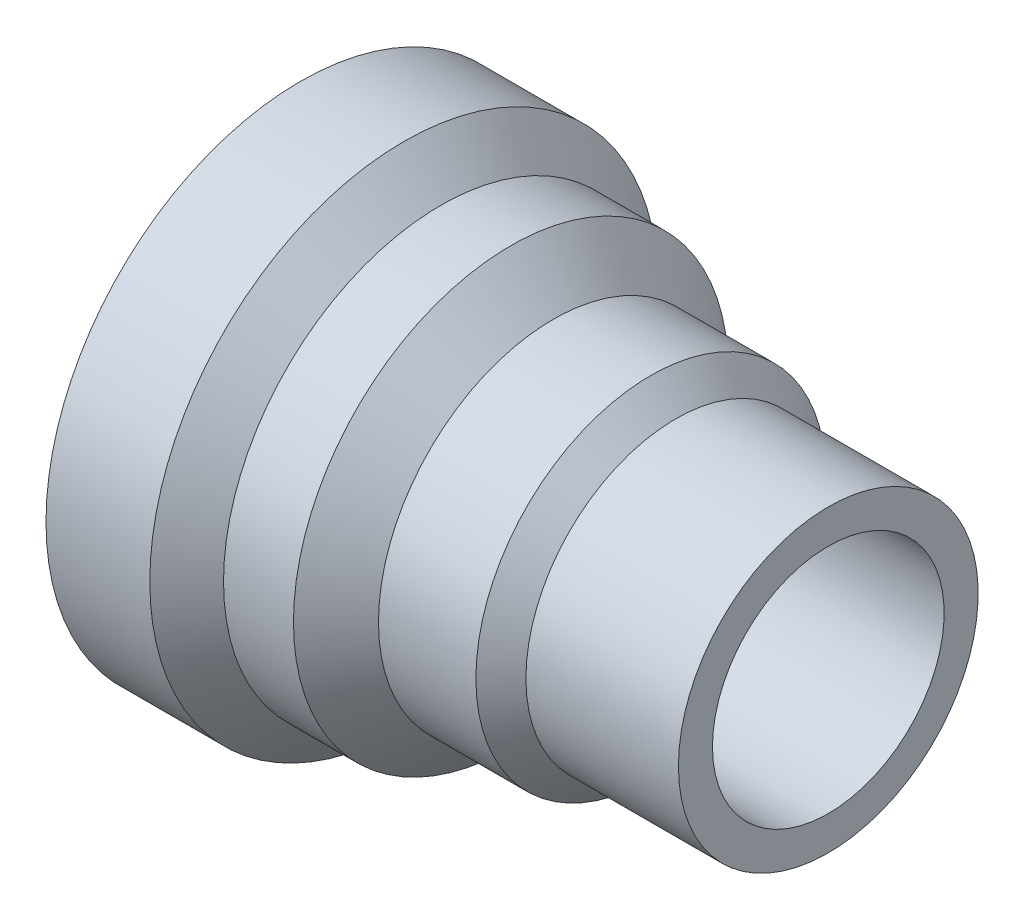
ISO-10303-21;
HEADER;
FILE_DESCRIPTION(('STEP AP214'),'2;1');
FILE_NAME('part.step','',(''),(''),'','','');
FILE_SCHEMA(('AUTOMOTIVE_DESIGN { 1 0 10303 214 1 1 1 1 }'));
ENDSEC;
DATA;
#1=APPLICATION_CONTEXT('core data for automotive mechanical design processes');
#2=APPLICATION_PROTOCOL_DEFINITION('international standard','automotive_design',2000,#1);
#3=PRODUCT_CONTEXT('',#1,'mechanical');
#4=PRODUCT('Part','Part','',(#3));
#5=PRODUCT_RELATED_PRODUCT_CATEGORY('part','',(#4));
#6=PRODUCT_DEFINITION_FORMATION('','',#4);
#7=PRODUCT_DEFINITION_CONTEXT('part definition',#1,'design');
#8=PRODUCT_DEFINITION('design','',#6,#7);
#9=PRODUCT_DEFINITION_SHAPE('','',#8);
#10=(LENGTH_UNIT() NAMED_UNIT(*) SI_UNIT(.MILLI.,.METRE.));
#11=(NAMED_UNIT(*) PLANE_ANGLE_UNIT() SI_UNIT($,.RADIAN.));
#12=(NAMED_UNIT(*) SI_UNIT($,.STERADIAN.) SOLID_ANGLE_UNIT());
#13=UNCERTAINTY_MEASURE_WITH_UNIT(LENGTH_MEASURE(1.E-05),#10,'distance_accuracy_value','');
#14=(GEOMETRIC_REPRESENTATION_CONTEXT(3) GLOBAL_UNCERTAINTY_ASSIGNED_CONTEXT((#13)) GLOBAL_UNIT_ASSIGNED_CONTEXT((#10,
#11,#12)) REPRESENTATION_CONTEXT('',''));
#15=CARTESIAN_POINT('',(0.,0.,0.));
#16=DIRECTION('',(0.,0.,1.));
#17=DIRECTION('',(1.,0.,0.));
#18=AXIS2_PLACEMENT_3D('',#15,#16,#17);
#19=CARTESIAN_POINT('',(-34.6699042016733,16.246643918254,0.));
#20=DIRECTION('',(-1.,0.,0.));
#21=DIRECTION('',(0.,0.,1.));
#22=AXIS2_PLACEMENT_3D('',#19,#20,#21);
#23=CYLINDRICAL_SURFACE('',#22,14.1002457607372);
#24=CARTESIAN_POINT('',(29.6052420583106,16.246643918254,0.));
#25=DIRECTION('',(-1.,0.,0.));
#26=DIRECTION('',(0.,0.,1.));
#27=AXIS2_PLACEMENT_3D('',#24,#25,#26);
#28=CIRCLE('',#27,14.1002457607372);
#29=CARTESIAN_POINT('',(29.6052420583106,16.246643918254,14.1002457607372));
#30=VERTEX_POINT('',#29);
#31=EDGE_CURVE('E65',#30,#30,#28,.T.);
#32=ORIENTED_EDGE('',*,*,#31,.F.);
#33=EDGE_LOOP('',(#32));
#34=FACE_BOUND('',#33,.T.);
#35=CARTESIAN_POINT('',(-34.6699042016733,16.246643918254,0.));
#36=DIRECTION('',(-1.,0.,0.));
#37=DIRECTION('',(0.,0.,1.));
#38=AXIS2_PLACEMENT_3D('',#35,#36,#37);
#39=CIRCLE('',#38,14.1002457607372);
#40=CARTESIAN_POINT('',(-34.6699042016733,16.246643918254,14.1002457607372));
#41=VERTEX_POINT('',#40);
#42=EDGE_CURVE('E10',#41,#41,#39,.T.);
#43=ORIENTED_EDGE('',*,*,#42,.T.);
#44=EDGE_LOOP('',(#43));
#45=FACE_BOUND('',#44,.T.);
#46=ADVANCED_FACE('F31',(#34,#45),#23,.F.);
#47=CARTESIAN_POINT('',(-34.6699042016733,30.3468896789911,0.));
#48=DIRECTION('',(1.,0.,0.));
#49=DIRECTION('',(0.,0.,-1.));
#50=AXIS2_PLACEMENT_3D('',#47,#48,#49);
#51=PLANE('',#50);
#52=ORIENTED_EDGE('',*,*,#42,.F.);
#53=EDGE_LOOP('',(#52));
#54=FACE_BOUND('',#53,.T.);
#55=CARTESIAN_POINT('',(-34.6699042016733,16.246643918254,0.));
#56=DIRECTION('',(-1.,0.,0.));
#57=DIRECTION('',(0.,0.,1.));
#58=AXIS2_PLACEMENT_3D('',#55,#56,#57);
#59=CIRCLE('',#58,30.9472926436959);
#60=CARTESIAN_POINT('',(-34.6699042016733,16.246643918254,30.9472926436959));
#61=VERTEX_POINT('',#60);
#62=EDGE_CURVE('E37',#61,#61,#59,.T.);
#63=ORIENTED_EDGE('',*,*,#62,.T.);
#64=EDGE_LOOP('',(#63));
#65=FACE_BOUND('',#64,.T.);
#66=ADVANCED_FACE('F72',(#54,#65),#51,.F.);
#67=CARTESIAN_POINT('',(-34.6699042016733,16.246643918254,0.));
#68=DIRECTION('',(-1.,0.,0.));
#69=DIRECTION('',(0.,0.,1.));
#70=AXIS2_PLACEMENT_3D('',#67,#68,#69);
#71=CYLINDRICAL_SURFACE('',#70,30.9472926436959);
#72=ORIENTED_EDGE('',*,*,#62,.F.);
#73=EDGE_LOOP('',(#72));
#74=FACE_BOUND('',#73,.T.);
#75=CARTESIAN_POINT('',(-22.0346190394542,16.246643918254,0.));
#76=DIRECTION('',(-1.,0.,0.));
#77=DIRECTION('',(0.,0.,1.));
#78=AXIS2_PLACEMENT_3D('',#75,#76,#77);
#79=CIRCLE('',#78,30.9472926436959);
#80=CARTESIAN_POINT('',(-22.0346190394542,16.246643918254,30.9472926436959));
#81=VERTEX_POINT('',#80);
#82=EDGE_CURVE('E41',#81,#81,#79,.T.);
#83=ORIENTED_EDGE('',*,*,#82,.T.);
#84=EDGE_LOOP('',(#83));
#85=FACE_BOUND('',#84,.T.);
#86=ADVANCED_FACE('F76',(#74,#85),#71,.T.);
#87=CARTESIAN_POINT('',(-17.5481772064924,16.246643918254,0.));
#88=DIRECTION('',(-1.,0.,0.));
#89=DIRECTION('',(0.,0.,1.));
#90=AXIS2_PLACEMENT_3D('',#87,#88,#89);
#91=CONICAL_SURFACE('',#90,26.4608508107341,0.785398163397436);
#92=ORIENTED_EDGE('',*,*,#82,.F.);
#93=EDGE_LOOP('',(#92));
#94=FACE_BOUND('',#93,.T.);
#95=CARTESIAN_POINT('',(-17.5481772064924,16.246643918254,0.));
#96=DIRECTION('',(-1.,0.,0.));
#97=DIRECTION('',(0.,0.,1.));
#98=AXIS2_PLACEMENT_3D('',#95,#96,#97);
#99=CIRCLE('',#98,26.4608508107341);
#100=CARTESIAN_POINT('',(-17.5481772064924,16.246643918254,26.4608508107341));
#101=VERTEX_POINT('',#100);
#102=EDGE_CURVE('E45',#101,#101,#99,.T.);
#103=ORIENTED_EDGE('',*,*,#102,.T.);
#104=EDGE_LOOP('',(#103));
#105=FACE_BOUND('',#104,.T.);
#106=ADVANCED_FACE('F81',(#94,#105),#91,.T.);
#107=CARTESIAN_POINT('',(-34.6699042016733,16.246643918254,0.));
#108=DIRECTION('',(-1.,0.,0.));
#109=DIRECTION('',(0.,0.,1.));
#110=AXIS2_PLACEMENT_3D('',#107,#108,#109);
#111=CYLINDRICAL_SURFACE('',#110,26.4608508107341);
#112=ORIENTED_EDGE('',*,*,#102,.F.);
#113=EDGE_LOOP('',(#112));
#114=FACE_BOUND('',#113,.T.);
#115=CARTESIAN_POINT('',(-9.03309372760566,16.246643918254,0.));
#116=DIRECTION('',(-1.,0.,0.));
#117=DIRECTION('',(0.,0.,1.));
#118=AXIS2_PLACEMENT_3D('',#115,#116,#117);
#119=CIRCLE('',#118,26.4608508107341);
#120=CARTESIAN_POINT('',(-9.03309372760566,16.246643918254,26.4608508107341));
#121=VERTEX_POINT('',#120);
#122=EDGE_CURVE('E50',#121,#121,#119,.T.);
#123=ORIENTED_EDGE('',*,*,#122,.T.);
#124=EDGE_LOOP('',(#123));
#125=FACE_BOUND('',#124,.T.);
#126=ADVANCED_FACE('F87',(#114,#125),#111,.T.);
#127=CARTESIAN_POINT('',(-3.85995161408835,16.246643918254,0.));
#128=DIRECTION('',(-1.,0.,0.));
#129=DIRECTION('',(0.,0.,1.));
#130=AXIS2_PLACEMENT_3D('',#127,#128,#129);
#131=CONICAL_SURFACE('',#130,21.287708697217,0.785398163397436);
#132=ORIENTED_EDGE('',*,*,#122,.F.);
#133=EDGE_LOOP('',(#132));
#134=FACE_BOUND('',#133,.T.);
#135=CARTESIAN_POINT('',(-3.85995161408835,16.246643918254,0.));
#136=DIRECTION('',(-1.,0.,0.));
#137=DIRECTION('',(0.,0.,1.));
#138=AXIS2_PLACEMENT_3D('',#135,#136,#137);
#139=CIRCLE('',#138,21.287708697217);
#140=CARTESIAN_POINT('',(-3.85995161408835,16.246643918254,21.287708697217));
#141=VERTEX_POINT('',#140);
#142=EDGE_CURVE('E53',#141,#141,#139,.T.);
#143=ORIENTED_EDGE('',*,*,#142,.T.);
#144=EDGE_LOOP('',(#143));
#145=FACE_BOUND('',#144,.T.);
#146=ADVANCED_FACE('F91',(#134,#145),#131,.T.);
#147=CARTESIAN_POINT('',(-34.6699042016733,16.246643918254,0.));
#148=DIRECTION('',(-1.,0.,0.));
#149=DIRECTION('',(0.,0.,1.));
#150=AXIS2_PLACEMENT_3D('',#147,#148,#149);
#151=CYLINDRICAL_SURFACE('',#150,21.287708697217);
#152=ORIENTED_EDGE('',*,*,#142,.F.);
#153=EDGE_LOOP('',(#152));
#154=FACE_BOUND('',#153,.T.);
#155=CARTESIAN_POINT('',(7.99707323016785,16.246643918254,0.));
#156=DIRECTION('',(-1.,0.,0.));
#157=DIRECTION('',(0.,0.,1.));
#158=AXIS2_PLACEMENT_3D('',#155,#156,#157);
#159=CIRCLE('',#158,21.287708697217);
#160=CARTESIAN_POINT('',(7.99707323016785,16.246643918254,21.287708697217));
#161=VERTEX_POINT('',#160);
#162=EDGE_CURVE('E56',#161,#161,#159,.T.);
#163=ORIENTED_EDGE('',*,*,#162,.T.);
#164=EDGE_LOOP('',(#163));
#165=FACE_BOUND('',#164,.T.);
#166=ADVANCED_FACE('F95',(#154,#165),#151,.T.);
#167=CARTESIAN_POINT('',(11.0414444739635,16.246643918254,0.));
#168=DIRECTION('',(-1.,0.,0.));
#169=DIRECTION('',(0.,0.,1.));
#170=AXIS2_PLACEMENT_3D('',#167,#168,#169);
#171=CONICAL_SURFACE('',#170,18.2433374534214,0.785398163397436);
#172=ORIENTED_EDGE('',*,*,#162,.F.);
#173=EDGE_LOOP('',(#172));
#174=FACE_BOUND('',#173,.T.);
#175=CARTESIAN_POINT('',(11.0414444739635,16.246643918254,0.));
#176=DIRECTION('',(-1.,0.,0.));
#177=DIRECTION('',(0.,0.,1.));
#178=AXIS2_PLACEMENT_3D('',#175,#176,#177);
#179=CIRCLE('',#178,18.2433374534214);
#180=CARTESIAN_POINT('',(11.0414444739635,16.246643918254,18.2433374534214));
#181=VERTEX_POINT('',#180);
#182=EDGE_CURVE('E59',#181,#181,#179,.T.);
#183=ORIENTED_EDGE('',*,*,#182,.T.);
#184=EDGE_LOOP('',(#183));
#185=FACE_BOUND('',#184,.T.);
#186=ADVANCED_FACE('F99',(#174,#185),#171,.T.);
#187=CARTESIAN_POINT('',(-34.6699042016733,16.246643918254,0.));
#188=DIRECTION('',(-1.,0.,0.));
#189=DIRECTION('',(0.,0.,1.));
#190=AXIS2_PLACEMENT_3D('',#187,#188,#189);
#191=CYLINDRICAL_SURFACE('',#190,18.2433374534214);
#192=ORIENTED_EDGE('',*,*,#182,.F.);
#193=EDGE_LOOP('',(#192));
#194=FACE_BOUND('',#193,.T.);
#195=CARTESIAN_POINT('',(29.6052420583106,16.246643918254,0.));
#196=DIRECTION('',(-1.,0.,0.));
#197=DIRECTION('',(0.,0.,1.));
#198=AXIS2_PLACEMENT_3D('',#195,#196,#197);
#199=CIRCLE('',#198,18.2433374534214);
#200=CARTESIAN_POINT('',(29.6052420583106,16.246643918254,18.2433374534214));
#201=VERTEX_POINT('',#200);
#202=EDGE_CURVE('E62',#201,#201,#199,.T.);
#203=ORIENTED_EDGE('',*,*,#202,.T.);
#204=EDGE_LOOP('',(#203));
#205=FACE_BOUND('',#204,.T.);
#206=ADVANCED_FACE('F103',(#194,#205),#191,.T.);
#207=CARTESIAN_POINT('',(29.6052420583106,34.4899813716754,0.));
#208=DIRECTION('',(-1.,0.,0.));
#209=DIRECTION('',(0.,0.,1.));
#210=AXIS2_PLACEMENT_3D('',#207,#208,#209);
#211=PLANE('',#210);
#212=ORIENTED_EDGE('',*,*,#202,.F.);
#213=EDGE_LOOP('',(#212));
#214=FACE_BOUND('',#213,.T.);
#215=ORIENTED_EDGE('',*,*,#31,.T.);
#216=EDGE_LOOP('',(#215));
#217=FACE_BOUND('',#216,.T.);
#218=ADVANCED_FACE('F69',(#214,#217),#211,.F.);
#219=CLOSED_SHELL('',(#46,#66,#86,#106,#126,#146,#166,#186,#206,#218));
#220=MANIFOLD_SOLID_BREP('B2',#219);
#221=ADVANCED_BREP_SHAPE_REPRESENTATION('',(#18,#220),#14);
#222=SHAPE_DEFINITION_REPRESENTATION(#9,#221);
ENDSEC;
END-ISO-10303-21;
